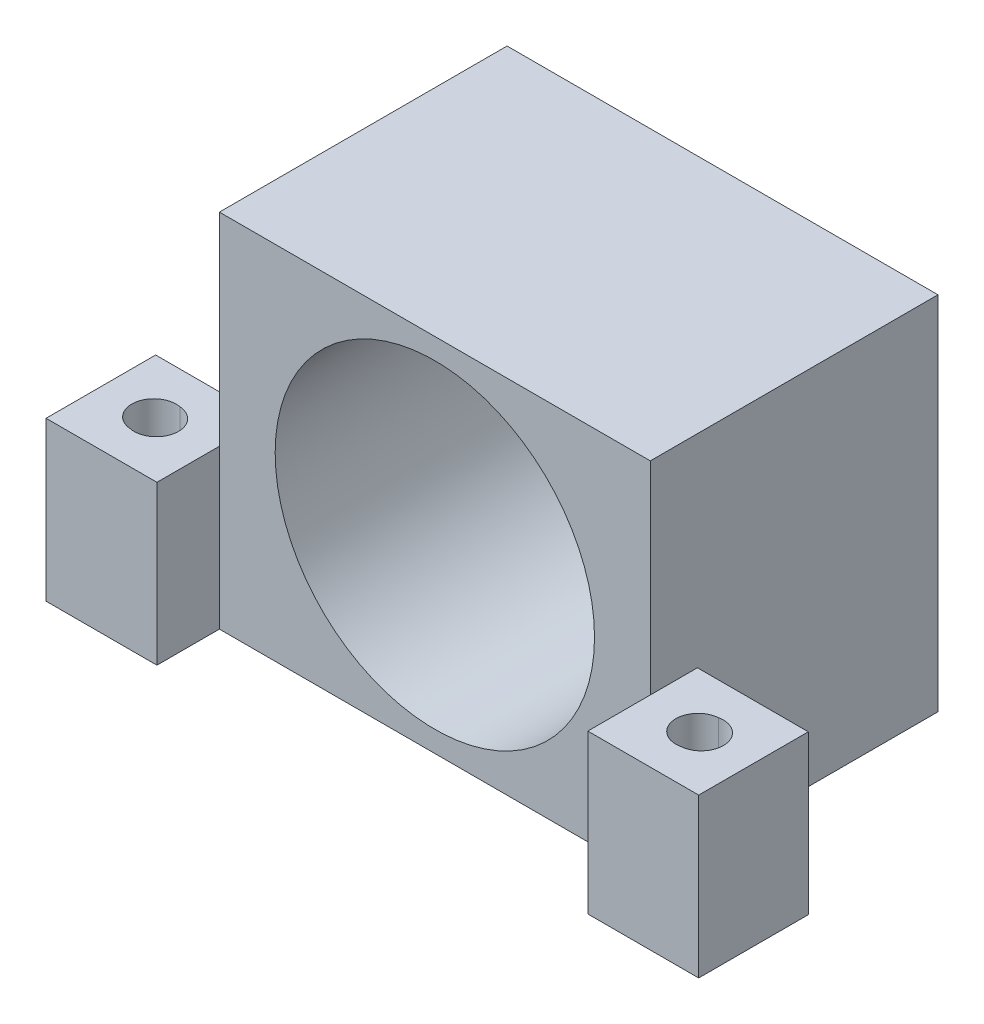
ISO-10303-21;
HEADER;
FILE_DESCRIPTION(('STEP AP214'),'2;1');
FILE_NAME('part.step','',(''),(''),'','','');
FILE_SCHEMA(('AUTOMOTIVE_DESIGN { 1 0 10303 214 1 1 1 1 }'));
ENDSEC;
DATA;
#1=APPLICATION_CONTEXT('core data for automotive mechanical design processes');
#2=APPLICATION_PROTOCOL_DEFINITION('international standard','automotive_design',2000,#1);
#3=PRODUCT_CONTEXT('',#1,'mechanical');
#4=PRODUCT('Part','Part','',(#3));
#5=PRODUCT_RELATED_PRODUCT_CATEGORY('part','',(#4));
#6=PRODUCT_DEFINITION_FORMATION('','',#4);
#7=PRODUCT_DEFINITION_CONTEXT('part definition',#1,'design');
#8=PRODUCT_DEFINITION('design','',#6,#7);
#9=PRODUCT_DEFINITION_SHAPE('','',#8);
#10=(LENGTH_UNIT() NAMED_UNIT(*) SI_UNIT(.MILLI.,.METRE.));
#11=(NAMED_UNIT(*) PLANE_ANGLE_UNIT() SI_UNIT($,.RADIAN.));
#12=(NAMED_UNIT(*) SI_UNIT($,.STERADIAN.) SOLID_ANGLE_UNIT());
#13=UNCERTAINTY_MEASURE_WITH_UNIT(LENGTH_MEASURE(1.E-05),#10,'distance_accuracy_value','');
#14=(GEOMETRIC_REPRESENTATION_CONTEXT(3) GLOBAL_UNCERTAINTY_ASSIGNED_CONTEXT((#13)) GLOBAL_UNIT_ASSIGNED_CONTEXT((#10,
#11,#12)) REPRESENTATION_CONTEXT('',''));
#15=CARTESIAN_POINT('',(0.,0.,0.));
#16=DIRECTION('',(0.,0.,1.));
#17=DIRECTION('',(1.,0.,0.));
#18=AXIS2_PLACEMENT_3D('',#15,#16,#17);
#19=CARTESIAN_POINT('',(21.375,-14.25,23.305));
#20=DIRECTION('',(0.,1.,0.));
#21=DIRECTION('',(-1.,0.,0.));
#22=AXIS2_PLACEMENT_3D('',#19,#20,#21);
#23=CYLINDRICAL_SURFACE('',#22,1.75);
#24=CARTESIAN_POINT('',(21.375,-11.075,23.305));
#25=DIRECTION('',(0.,-1.,0.));
#26=DIRECTION('',(1.,0.,0.));
#27=AXIS2_PLACEMENT_3D('',#24,#25,#26);
#28=CIRCLE('',#27,1.75);
#29=CARTESIAN_POINT('',(21.2411225701097,-11.075,21.5601284191191));
#30=VERTEX_POINT('',#29);
#31=CARTESIAN_POINT('',(21.7238774298904,-11.075,25.0198715808809));
#32=VERTEX_POINT('',#31);
#33=EDGE_CURVE('E175',#30,#32,#28,.F.);
#34=ORIENTED_EDGE('',*,*,#33,.F.);
#35=DIRECTION('',(0.,1.,0.));
#36=VECTOR('',#35,1.);
#37=CARTESIAN_POINT('',(21.2411225701097,-23.75,21.5601284191191));
#38=LINE('',#37,#36);
#39=CARTESIAN_POINT('',(21.2411225701097,-1.75,21.5601284191191));
#40=VERTEX_POINT('',#39);
#41=EDGE_CURVE('E55',#30,#40,#38,.T.);
#42=ORIENTED_EDGE('',*,*,#41,.T.);
#43=CARTESIAN_POINT('',(21.375,-1.75,23.305));
#44=DIRECTION('',(0.,1.,0.));
#45=DIRECTION('',(-1.,0.,0.));
#46=AXIS2_PLACEMENT_3D('',#43,#44,#45);
#47=CIRCLE('',#46,1.75);
#48=CARTESIAN_POINT('',(21.7238774298904,-1.75,25.0198715808809));
#49=VERTEX_POINT('',#48);
#50=EDGE_CURVE('E166',#40,#49,#47,.T.);
#51=ORIENTED_EDGE('',*,*,#50,.T.);
#52=DIRECTION('',(0.,1.,0.));
#53=VECTOR('',#52,1.);
#54=CARTESIAN_POINT('',(21.7238774298904,-23.75,25.0198715808809));
#55=LINE('',#54,#53);
#56=EDGE_CURVE('E343',#49,#32,#55,.F.);
#57=ORIENTED_EDGE('',*,*,#56,.T.);
#58=EDGE_LOOP('',(#34,#42,#51,#57));
#59=FACE_BOUND('',#58,.T.);
#60=ADVANCED_FACE('F33',(#59),#23,.F.);
#61=CARTESIAN_POINT('',(-21.375,-14.25,23.305));
#62=DIRECTION('',(0.,1.,0.));
#63=DIRECTION('',(-1.,0.,0.));
#64=AXIS2_PLACEMENT_3D('',#61,#62,#63);
#65=CYLINDRICAL_SURFACE('',#64,1.75);
#66=CARTESIAN_POINT('',(-21.375,-11.075,23.305));
#67=DIRECTION('',(0.,-1.,0.));
#68=DIRECTION('',(1.,0.,0.));
#69=AXIS2_PLACEMENT_3D('',#66,#67,#68);
#70=CIRCLE('',#69,1.75);
#71=CARTESIAN_POINT('',(-21.7238774298903,-11.075,25.019871580881));
#72=VERTEX_POINT('',#71);
#73=CARTESIAN_POINT('',(-21.2411225701095,-11.075,21.5601284191191));
#74=VERTEX_POINT('',#73);
#75=EDGE_CURVE('E158',#72,#74,#70,.F.);
#76=ORIENTED_EDGE('',*,*,#75,.F.);
#77=DIRECTION('',(0.,1.,0.));
#78=VECTOR('',#77,1.);
#79=CARTESIAN_POINT('',(-21.7238774298903,-23.75,25.019871580881));
#80=LINE('',#79,#78);
#81=CARTESIAN_POINT('',(-21.7238774298903,-1.75,25.019871580881));
#82=VERTEX_POINT('',#81);
#83=EDGE_CURVE('E47',#72,#82,#80,.T.);
#84=ORIENTED_EDGE('',*,*,#83,.T.);
#85=CARTESIAN_POINT('',(-21.375,-1.75,23.305));
#86=DIRECTION('',(0.,1.,0.));
#87=DIRECTION('',(-1.,0.,0.));
#88=AXIS2_PLACEMENT_3D('',#85,#86,#87);
#89=CIRCLE('',#88,1.75);
#90=CARTESIAN_POINT('',(-21.2411225701095,-1.75,21.5601284191191));
#91=VERTEX_POINT('',#90);
#92=EDGE_CURVE('E160',#82,#91,#89,.T.);
#93=ORIENTED_EDGE('',*,*,#92,.T.);
#94=DIRECTION('',(0.,1.,0.));
#95=VECTOR('',#94,1.);
#96=CARTESIAN_POINT('',(-21.2411225701095,-23.75,21.5601284191191));
#97=LINE('',#96,#95);
#98=EDGE_CURVE('E150',#91,#74,#97,.F.);
#99=ORIENTED_EDGE('',*,*,#98,.T.);
#100=EDGE_LOOP('',(#76,#84,#93,#99));
#101=FACE_BOUND('',#100,.T.);
#102=ADVANCED_FACE('F157',(#101),#65,.F.);
#103=CARTESIAN_POINT('',(17.,14.25,22.7));
#104=DIRECTION('',(-1.,0.,0.));
#105=DIRECTION('',(0.,0.,1.));
#106=AXIS2_PLACEMENT_3D('',#103,#104,#105);
#107=PLANE('',#106);
#108=DIRECTION('',(0.,0.,1.));
#109=VECTOR('',#108,1.);
#110=CARTESIAN_POINT('',(17.,-1.75,18.98));
#111=LINE('',#110,#109);
#112=CARTESIAN_POINT('',(17.,-1.75,18.98));
#113=VERTEX_POINT('',#112);
#114=CARTESIAN_POINT('',(17.,-1.75,22.7));
#115=VERTEX_POINT('',#114);
#116=EDGE_CURVE('E289',#113,#115,#111,.T.);
#117=ORIENTED_EDGE('',*,*,#116,.F.);
#118=DIRECTION('',(0.,-1.,0.));
#119=VECTOR('',#118,1.);
#120=CARTESIAN_POINT('',(17.,-1.75,18.98));
#121=LINE('',#120,#119);
#122=CARTESIAN_POINT('',(17.,-14.25,18.98));
#123=VERTEX_POINT('',#122);
#124=EDGE_CURVE('E308',#113,#123,#121,.T.);
#125=ORIENTED_EDGE('',*,*,#124,.T.);
#126=DIRECTION('',(0.,0.,-1.));
#127=VECTOR('',#126,1.);
#128=CARTESIAN_POINT('',(17.,-14.25,22.7));
#129=LINE('',#128,#127);
#130=CARTESIAN_POINT('',(17.,-14.25,0.));
#131=VERTEX_POINT('',#130);
#132=EDGE_CURVE('E194',#123,#131,#129,.T.);
#133=ORIENTED_EDGE('',*,*,#132,.T.);
#134=DIRECTION('',(0.,1.,0.));
#135=VECTOR('',#134,1.);
#136=CARTESIAN_POINT('',(17.,14.25,0.));
#137=LINE('',#136,#135);
#138=CARTESIAN_POINT('',(17.,14.25,0.));
#139=VERTEX_POINT('',#138);
#140=EDGE_CURVE('E214',#131,#139,#137,.T.);
#141=ORIENTED_EDGE('',*,*,#140,.T.);
#142=DIRECTION('',(0.,0.,-1.));
#143=VECTOR('',#142,1.);
#144=CARTESIAN_POINT('',(17.,14.25,22.7));
#145=LINE('',#144,#143);
#146=CARTESIAN_POINT('',(17.,14.25,22.7));
#147=VERTEX_POINT('',#146);
#148=EDGE_CURVE('E200',#147,#139,#145,.T.);
#149=ORIENTED_EDGE('',*,*,#148,.F.);
#150=DIRECTION('',(0.,1.,0.));
#151=VECTOR('',#150,1.);
#152=CARTESIAN_POINT('',(17.,14.25,22.7));
#153=LINE('',#152,#151);
#154=EDGE_CURVE('E226',#115,#147,#153,.T.);
#155=ORIENTED_EDGE('',*,*,#154,.F.);
#156=EDGE_LOOP('',(#117,#125,#133,#141,#149,#155));
#157=FACE_BOUND('',#156,.T.);
#158=ADVANCED_FACE('F391',(#157),#107,.F.);
#159=CARTESIAN_POINT('',(-17.,14.25,22.7));
#160=DIRECTION('',(1.,0.,0.));
#161=DIRECTION('',(0.,0.,-1.));
#162=AXIS2_PLACEMENT_3D('',#159,#160,#161);
#163=PLANE('',#162);
#164=DIRECTION('',(0.,1.,0.));
#165=VECTOR('',#164,1.);
#166=CARTESIAN_POINT('',(-17.,-1.75,18.98));
#167=LINE('',#166,#165);
#168=CARTESIAN_POINT('',(-17.,-14.25,18.98));
#169=VERTEX_POINT('',#168);
#170=CARTESIAN_POINT('',(-17.,-1.75,18.98));
#171=VERTEX_POINT('',#170);
#172=EDGE_CURVE('E274',#169,#171,#167,.T.);
#173=ORIENTED_EDGE('',*,*,#172,.T.);
#174=DIRECTION('',(0.,0.,1.));
#175=VECTOR('',#174,1.);
#176=CARTESIAN_POINT('',(-17.,-1.75,18.98));
#177=LINE('',#176,#175);
#178=CARTESIAN_POINT('',(-17.,-1.75,22.7));
#179=VERTEX_POINT('',#178);
#180=EDGE_CURVE('E257',#171,#179,#177,.T.);
#181=ORIENTED_EDGE('',*,*,#180,.T.);
#182=DIRECTION('',(0.,-1.,0.));
#183=VECTOR('',#182,1.);
#184=CARTESIAN_POINT('',(-17.,14.25,22.7));
#185=LINE('',#184,#183);
#186=CARTESIAN_POINT('',(-17.,14.25,22.7));
#187=VERTEX_POINT('',#186);
#188=EDGE_CURVE('E230',#187,#179,#185,.T.);
#189=ORIENTED_EDGE('',*,*,#188,.F.);
#190=DIRECTION('',(0.,0.,-1.));
#191=VECTOR('',#190,1.);
#192=CARTESIAN_POINT('',(-17.,14.25,22.7));
#193=LINE('',#192,#191);
#194=CARTESIAN_POINT('',(-17.,14.25,0.));
#195=VERTEX_POINT('',#194);
#196=EDGE_CURVE('E205',#187,#195,#193,.T.);
#197=ORIENTED_EDGE('',*,*,#196,.T.);
#198=DIRECTION('',(0.,-1.,0.));
#199=VECTOR('',#198,1.);
#200=CARTESIAN_POINT('',(-17.,14.25,0.));
#201=LINE('',#200,#199);
#202=CARTESIAN_POINT('',(-17.,-14.25,0.));
#203=VERTEX_POINT('',#202);
#204=EDGE_CURVE('E218',#195,#203,#201,.T.);
#205=ORIENTED_EDGE('',*,*,#204,.T.);
#206=DIRECTION('',(0.,0.,-1.));
#207=VECTOR('',#206,1.);
#208=CARTESIAN_POINT('',(-17.,-14.25,22.7));
#209=LINE('',#208,#207);
#210=EDGE_CURVE('E173',#169,#203,#209,.T.);
#211=ORIENTED_EDGE('',*,*,#210,.F.);
#212=EDGE_LOOP('',(#173,#181,#189,#197,#205,#211));
#213=FACE_BOUND('',#212,.T.);
#214=ADVANCED_FACE('F35',(#213),#163,.F.);
#215=CARTESIAN_POINT('',(17.,-14.25,22.7));
#216=DIRECTION('',(0.,1.,0.));
#217=DIRECTION('',(0.,0.,1.));
#218=AXIS2_PLACEMENT_3D('',#215,#216,#217);
#219=PLANE('',#218);
#220=CARTESIAN_POINT('',(21.375,-14.25,23.305));
#221=DIRECTION('',(0.,-1.,0.));
#222=DIRECTION('',(1.,0.,0.));
#223=AXIS2_PLACEMENT_3D('',#220,#221,#222);
#224=CIRCLE('',#223,3.25);
#225=CARTESIAN_POINT('',(24.625,-14.25,23.305));
#226=VERTEX_POINT('',#225);
#227=EDGE_CURVE('E182',#226,#226,#224,.T.);
#228=ORIENTED_EDGE('',*,*,#227,.F.);
#229=EDGE_LOOP('',(#228));
#230=FACE_BOUND('',#229,.T.);
#231=CARTESIAN_POINT('',(-21.375,-14.25,23.305));
#232=DIRECTION('',(0.,-1.,0.));
#233=DIRECTION('',(1.,0.,0.));
#234=AXIS2_PLACEMENT_3D('',#231,#232,#233);
#235=CIRCLE('',#234,3.25);
#236=CARTESIAN_POINT('',(-18.125,-14.25,23.305));
#237=VERTEX_POINT('',#236);
#238=EDGE_CURVE('E169',#237,#237,#235,.T.);
#239=ORIENTED_EDGE('',*,*,#238,.F.);
#240=EDGE_LOOP('',(#239));
#241=FACE_BOUND('',#240,.T.);
#242=DIRECTION('',(1.,0.,0.));
#243=VECTOR('',#242,1.);
#244=CARTESIAN_POINT('',(17.,-14.25,0.));
#245=LINE('',#244,#243);
#246=EDGE_CURVE('E216',#203,#131,#245,.T.);
#247=ORIENTED_EDGE('',*,*,#246,.T.);
#248=ORIENTED_EDGE('',*,*,#132,.F.);
#249=DIRECTION('',(1.,0.,0.));
#250=VECTOR('',#249,1.);
#251=CARTESIAN_POINT('',(17.,-14.25,18.98));
#252=LINE('',#251,#250);
#253=CARTESIAN_POINT('',(25.75,-14.25,18.98));
#254=VERTEX_POINT('',#253);
#255=EDGE_CURVE('E305',#123,#254,#252,.T.);
#256=ORIENTED_EDGE('',*,*,#255,.T.);
#257=DIRECTION('',(0.,0.,1.));
#258=VECTOR('',#257,1.);
#259=CARTESIAN_POINT('',(25.75,-14.25,18.98));
#260=LINE('',#259,#258);
#261=CARTESIAN_POINT('',(25.75,-14.25,27.63));
#262=VERTEX_POINT('',#261);
#263=EDGE_CURVE('E292',#254,#262,#260,.T.);
#264=ORIENTED_EDGE('',*,*,#263,.T.);
#265=DIRECTION('',(1.,0.,0.));
#266=VECTOR('',#265,1.);
#267=CARTESIAN_POINT('',(17.,-14.25,27.63));
#268=LINE('',#267,#266);
#269=CARTESIAN_POINT('',(17.,-14.25,27.63));
#270=VERTEX_POINT('',#269);
#271=EDGE_CURVE('E316',#270,#262,#268,.T.);
#272=ORIENTED_EDGE('',*,*,#271,.F.);
#273=DIRECTION('',(0.,0.,1.));
#274=VECTOR('',#273,1.);
#275=CARTESIAN_POINT('',(17.,-14.25,18.98));
#276=LINE('',#275,#274);
#277=CARTESIAN_POINT('',(17.,-14.25,22.7));
#278=VERTEX_POINT('',#277);
#279=EDGE_CURVE('E290',#278,#270,#276,.T.);
#280=ORIENTED_EDGE('',*,*,#279,.F.);
#281=DIRECTION('',(1.,0.,0.));
#282=VECTOR('',#281,1.);
#283=CARTESIAN_POINT('',(17.,-14.25,22.7));
#284=LINE('',#283,#282);
#285=CARTESIAN_POINT('',(-17.,-14.25,22.7));
#286=VERTEX_POINT('',#285);
#287=EDGE_CURVE('E227',#286,#278,#284,.T.);
#288=ORIENTED_EDGE('',*,*,#287,.F.);
#289=DIRECTION('',(0.,0.,1.));
#290=VECTOR('',#289,1.);
#291=CARTESIAN_POINT('',(-17.,-14.25,18.98));
#292=LINE('',#291,#290);
#293=CARTESIAN_POINT('',(-17.,-14.25,27.63));
#294=VERTEX_POINT('',#293);
#295=EDGE_CURVE('E252',#286,#294,#292,.T.);
#296=ORIENTED_EDGE('',*,*,#295,.T.);
#297=DIRECTION('',(1.,0.,0.));
#298=VECTOR('',#297,1.);
#299=CARTESIAN_POINT('',(-17.,-14.25,27.63));
#300=LINE('',#299,#298);
#301=CARTESIAN_POINT('',(-25.75,-14.25,27.63));
#302=VERTEX_POINT('',#301);
#303=EDGE_CURVE('E277',#302,#294,#300,.T.);
#304=ORIENTED_EDGE('',*,*,#303,.F.);
#305=DIRECTION('',(0.,0.,1.));
#306=VECTOR('',#305,1.);
#307=CARTESIAN_POINT('',(-25.75,-14.25,18.98));
#308=LINE('',#307,#306);
#309=CARTESIAN_POINT('',(-25.75,-14.25,18.98));
#310=VERTEX_POINT('',#309);
#311=EDGE_CURVE('E263',#310,#302,#308,.T.);
#312=ORIENTED_EDGE('',*,*,#311,.F.);
#313=DIRECTION('',(1.,0.,0.));
#314=VECTOR('',#313,1.);
#315=CARTESIAN_POINT('',(-17.,-14.25,18.98));
#316=LINE('',#315,#314);
#317=EDGE_CURVE('E266',#310,#169,#316,.T.);
#318=ORIENTED_EDGE('',*,*,#317,.T.);
#319=ORIENTED_EDGE('',*,*,#210,.T.);
#320=EDGE_LOOP('',(#247,#248,#256,#264,#272,#280,#288,#296,#304,#312,#318,#319));
#321=FACE_BOUND('',#320,.T.);
#322=ADVANCED_FACE('F365',(#230,#241,#321),#219,.F.);
#323=CARTESIAN_POINT('',(-17.,14.25,22.7));
#324=DIRECTION('',(0.,-1.,0.));
#325=DIRECTION('',(0.,0.,-1.));
#326=AXIS2_PLACEMENT_3D('',#323,#324,#325);
#327=PLANE('',#326);
#328=DIRECTION('',(-1.,0.,0.));
#329=VECTOR('',#328,1.);
#330=CARTESIAN_POINT('',(-17.,14.25,0.));
#331=LINE('',#330,#329);
#332=EDGE_CURVE('E211',#139,#195,#331,.T.);
#333=ORIENTED_EDGE('',*,*,#332,.T.);
#334=ORIENTED_EDGE('',*,*,#196,.F.);
#335=DIRECTION('',(-1.,0.,0.));
#336=VECTOR('',#335,1.);
#337=CARTESIAN_POINT('',(-17.,14.25,22.7));
#338=LINE('',#337,#336);
#339=EDGE_CURVE('E210',#147,#187,#338,.T.);
#340=ORIENTED_EDGE('',*,*,#339,.F.);
#341=ORIENTED_EDGE('',*,*,#148,.T.);
#342=EDGE_LOOP('',(#333,#334,#340,#341));
#343=FACE_BOUND('',#342,.T.);
#344=ADVANCED_FACE('F379',(#343),#327,.F.);
#345=CARTESIAN_POINT('',(0.,0.,22.7));
#346=DIRECTION('',(0.,0.,-1.));
#347=DIRECTION('',(-1.,0.,0.));
#348=AXIS2_PLACEMENT_3D('',#345,#346,#347);
#349=PLANE('',#348);
#350=CARTESIAN_POINT('',(0.,0.,22.7));
#351=DIRECTION('',(0.,0.,1.));
#352=DIRECTION('',(1.,0.,0.));
#353=AXIS2_PLACEMENT_3D('',#350,#351,#352);
#354=CIRCLE('',#353,12.6);
#355=CARTESIAN_POINT('',(12.6,0.,22.7));
#356=VERTEX_POINT('',#355);
#357=EDGE_CURVE('E233',#356,#356,#354,.T.);
#358=ORIENTED_EDGE('',*,*,#357,.F.);
#359=EDGE_LOOP('',(#358));
#360=FACE_BOUND('',#359,.T.);
#361=ORIENTED_EDGE('',*,*,#188,.T.);
#362=EDGE_CURVE('E213',#179,#286,#185,.T.);
#363=ORIENTED_EDGE('',*,*,#362,.T.);
#364=ORIENTED_EDGE('',*,*,#287,.T.);
#365=EDGE_CURVE('E223',#278,#115,#153,.T.);
#366=ORIENTED_EDGE('',*,*,#365,.T.);
#367=ORIENTED_EDGE('',*,*,#154,.T.);
#368=ORIENTED_EDGE('',*,*,#339,.T.);
#369=EDGE_LOOP('',(#361,#363,#364,#366,#367,#368));
#370=FACE_BOUND('',#369,.T.);
#371=ADVANCED_FACE('F373',(#360,#370),#349,.F.);
#372=CARTESIAN_POINT('',(0.,0.,0.));
#373=DIRECTION('',(0.,0.,-1.));
#374=DIRECTION('',(-1.,0.,0.));
#375=AXIS2_PLACEMENT_3D('',#372,#373,#374);
#376=PLANE('',#375);
#377=CARTESIAN_POINT('',(-6.01040764008568,6.01040764008562,0.));
#378=DIRECTION('',(0.,0.,-1.));
#379=DIRECTION('',(-1.,0.,0.));
#380=AXIS2_PLACEMENT_3D('',#377,#378,#379);
#381=CIRCLE('',#380,2.8);
#382=CARTESIAN_POINT('',(-8.81040764008569,6.01040764008562,0.));
#383=VERTEX_POINT('',#382);
#384=EDGE_CURVE('E188',#383,#383,#381,.T.);
#385=ORIENTED_EDGE('',*,*,#384,.F.);
#386=EDGE_LOOP('',(#385));
#387=FACE_BOUND('',#386,.T.);
#388=CARTESIAN_POINT('',(6.01040764008569,-6.01040764008562,0.));
#389=DIRECTION('',(0.,0.,-1.));
#390=DIRECTION('',(-1.,0.,0.));
#391=AXIS2_PLACEMENT_3D('',#388,#389,#390);
#392=CIRCLE('',#391,2.8);
#393=CARTESIAN_POINT('',(3.21040764008569,-6.01040764008562,0.));
#394=VERTEX_POINT('',#393);
#395=EDGE_CURVE('E335',#394,#394,#392,.T.);
#396=ORIENTED_EDGE('',*,*,#395,.F.);
#397=EDGE_LOOP('',(#396));
#398=FACE_BOUND('',#397,.T.);
#399=CARTESIAN_POINT('',(6.01040764008564,6.01040764008567,0.));
#400=DIRECTION('',(0.,0.,-1.));
#401=DIRECTION('',(-1.,0.,0.));
#402=AXIS2_PLACEMENT_3D('',#399,#400,#401);
#403=CIRCLE('',#402,2.8);
#404=CARTESIAN_POINT('',(3.21040764008564,6.01040764008567,0.));
#405=VERTEX_POINT('',#404);
#406=EDGE_CURVE('E332',#405,#405,#403,.T.);
#407=ORIENTED_EDGE('',*,*,#406,.F.);
#408=EDGE_LOOP('',(#407));
#409=FACE_BOUND('',#408,.T.);
#410=CARTESIAN_POINT('',(-6.01040764008564,-6.01040764008566,0.));
#411=DIRECTION('',(0.,0.,-1.));
#412=DIRECTION('',(-1.,0.,0.));
#413=AXIS2_PLACEMENT_3D('',#410,#411,#412);
#414=CIRCLE('',#413,2.8);
#415=CARTESIAN_POINT('',(-8.81040764008564,-6.01040764008566,0.));
#416=VERTEX_POINT('',#415);
#417=EDGE_CURVE('E183',#416,#416,#414,.T.);
#418=ORIENTED_EDGE('',*,*,#417,.F.);
#419=EDGE_LOOP('',(#418));
#420=FACE_BOUND('',#419,.T.);
#421=CARTESIAN_POINT('',(0.,0.,0.));
#422=DIRECTION('',(0.,0.,1.));
#423=DIRECTION('',(1.,0.,0.));
#424=AXIS2_PLACEMENT_3D('',#421,#422,#423);
#425=CIRCLE('',#424,3.75);
#426=CARTESIAN_POINT('',(3.75,0.,0.));
#427=VERTEX_POINT('',#426);
#428=EDGE_CURVE('E251',#427,#427,#425,.T.);
#429=ORIENTED_EDGE('',*,*,#428,.T.);
#430=EDGE_LOOP('',(#429));
#431=FACE_BOUND('',#430,.T.);
#432=ORIENTED_EDGE('',*,*,#204,.F.);
#433=ORIENTED_EDGE('',*,*,#332,.F.);
#434=ORIENTED_EDGE('',*,*,#140,.F.);
#435=ORIENTED_EDGE('',*,*,#246,.F.);
#436=EDGE_LOOP('',(#432,#433,#434,#435));
#437=FACE_BOUND('',#436,.T.);
#438=ADVANCED_FACE('F383',(#387,#398,#409,#420,#431,#437),#376,.T.);
#439=CARTESIAN_POINT('',(0.,0.,3.7));
#440=DIRECTION('',(0.,0.,1.));
#441=DIRECTION('',(1.,0.,0.));
#442=AXIS2_PLACEMENT_3D('',#439,#440,#441);
#443=CYLINDRICAL_SURFACE('',#442,12.6);
#444=CARTESIAN_POINT('',(0.,0.,3.7));
#445=DIRECTION('',(0.,0.,1.));
#446=DIRECTION('',(1.,0.,0.));
#447=AXIS2_PLACEMENT_3D('',#444,#445,#446);
#448=CIRCLE('',#447,12.6);
#449=CARTESIAN_POINT('',(12.6,0.,3.7));
#450=VERTEX_POINT('',#449);
#451=EDGE_CURVE('E221',#450,#450,#448,.T.);
#452=ORIENTED_EDGE('',*,*,#451,.F.);
#453=EDGE_LOOP('',(#452));
#454=FACE_BOUND('',#453,.T.);
#455=ORIENTED_EDGE('',*,*,#357,.T.);
#456=EDGE_LOOP('',(#455));
#457=FACE_BOUND('',#456,.T.);
#458=ADVANCED_FACE('F628',(#454,#457),#443,.F.);
#459=CARTESIAN_POINT('',(0.,0.,3.7));
#460=DIRECTION('',(0.,0.,1.));
#461=DIRECTION('',(1.,0.,0.));
#462=AXIS2_PLACEMENT_3D('',#459,#460,#461);
#463=PLANE('',#462);
#464=CARTESIAN_POINT('',(0.,0.,3.7));
#465=DIRECTION('',(0.,0.,1.));
#466=DIRECTION('',(1.,0.,0.));
#467=AXIS2_PLACEMENT_3D('',#464,#465,#466);
#468=CIRCLE('',#467,3.75);
#469=CARTESIAN_POINT('',(3.75,0.,3.7));
#470=VERTEX_POINT('',#469);
#471=EDGE_CURVE('E248',#470,#470,#468,.T.);
#472=ORIENTED_EDGE('',*,*,#471,.F.);
#473=EDGE_LOOP('',(#472));
#474=FACE_BOUND('',#473,.T.);
#475=CARTESIAN_POINT('',(-6.01040764008565,-6.01040764008566,3.7));
#476=DIRECTION('',(0.,0.,1.));
#477=DIRECTION('',(1.,0.,0.));
#478=AXIS2_PLACEMENT_3D('',#475,#476,#477);
#479=CIRCLE('',#478,1.625);
#480=CARTESIAN_POINT('',(-4.38540764008565,-6.01040764008566,3.7));
#481=VERTEX_POINT('',#480);
#482=EDGE_CURVE('E245',#481,#481,#479,.T.);
#483=ORIENTED_EDGE('',*,*,#482,.F.);
#484=EDGE_LOOP('',(#483));
#485=FACE_BOUND('',#484,.T.);
#486=CARTESIAN_POINT('',(6.01040764008566,-6.01040764008565,3.7));
#487=DIRECTION('',(0.,0.,1.));
#488=DIRECTION('',(1.,0.,0.));
#489=AXIS2_PLACEMENT_3D('',#486,#487,#488);
#490=CIRCLE('',#489,1.625);
#491=CARTESIAN_POINT('',(7.63540764008566,-6.01040764008565,3.7));
#492=VERTEX_POINT('',#491);
#493=EDGE_CURVE('E242',#492,#492,#490,.T.);
#494=ORIENTED_EDGE('',*,*,#493,.F.);
#495=EDGE_LOOP('',(#494));
#496=FACE_BOUND('',#495,.T.);
#497=CARTESIAN_POINT('',(-6.01040764008566,6.01040764008565,3.7));
#498=DIRECTION('',(0.,0.,1.));
#499=DIRECTION('',(1.,0.,0.));
#500=AXIS2_PLACEMENT_3D('',#497,#498,#499);
#501=CIRCLE('',#500,1.625);
#502=CARTESIAN_POINT('',(-4.38540764008566,6.01040764008565,3.7));
#503=VERTEX_POINT('',#502);
#504=EDGE_CURVE('E241',#503,#503,#501,.T.);
#505=ORIENTED_EDGE('',*,*,#504,.F.);
#506=EDGE_LOOP('',(#505));
#507=FACE_BOUND('',#506,.T.);
#508=CARTESIAN_POINT('',(6.01040764008565,6.01040764008566,3.7));
#509=DIRECTION('',(0.,0.,1.));
#510=DIRECTION('',(1.,0.,0.));
#511=AXIS2_PLACEMENT_3D('',#508,#509,#510);
#512=CIRCLE('',#511,1.625);
#513=CARTESIAN_POINT('',(7.63540764008565,6.01040764008566,3.7));
#514=VERTEX_POINT('',#513);
#515=EDGE_CURVE('E236',#514,#514,#512,.T.);
#516=ORIENTED_EDGE('',*,*,#515,.F.);
#517=EDGE_LOOP('',(#516));
#518=FACE_BOUND('',#517,.T.);
#519=ORIENTED_EDGE('',*,*,#451,.T.);
#520=EDGE_LOOP('',(#519));
#521=FACE_BOUND('',#520,.T.);
#522=ADVANCED_FACE('F636',(#474,#485,#496,#507,#518,#521),#463,.T.);
#523=CARTESIAN_POINT('',(6.01040764008565,6.01040764008566,0.));
#524=DIRECTION('',(0.,0.,1.));
#525=DIRECTION('',(1.,0.,0.));
#526=AXIS2_PLACEMENT_3D('',#523,#524,#525);
#527=CYLINDRICAL_SURFACE('',#526,1.625);
#528=CARTESIAN_POINT('',(6.01040764008564,6.01040764008567,1.175));
#529=DIRECTION('',(0.,0.,-1.));
#530=DIRECTION('',(-1.,0.,0.));
#531=AXIS2_PLACEMENT_3D('',#528,#529,#530);
#532=CIRCLE('',#531,1.625);
#533=CARTESIAN_POINT('',(4.38540764008564,6.01040764008567,1.175));
#534=VERTEX_POINT('',#533);
#535=EDGE_CURVE('E191',#534,#534,#532,.T.);
#536=ORIENTED_EDGE('',*,*,#535,.T.);
#537=EDGE_LOOP('',(#536));
#538=FACE_BOUND('',#537,.T.);
#539=ORIENTED_EDGE('',*,*,#515,.T.);
#540=EDGE_LOOP('',(#539));
#541=FACE_BOUND('',#540,.T.);
#542=ADVANCED_FACE('F644',(#538,#541),#527,.F.);
#543=CARTESIAN_POINT('',(-6.01040764008566,6.01040764008565,0.));
#544=DIRECTION('',(0.,0.,1.));
#545=DIRECTION('',(1.,0.,0.));
#546=AXIS2_PLACEMENT_3D('',#543,#544,#545);
#547=CYLINDRICAL_SURFACE('',#546,1.625);
#548=CARTESIAN_POINT('',(-6.01040764008568,6.01040764008562,1.175));
#549=DIRECTION('',(0.,0.,-1.));
#550=DIRECTION('',(-1.,0.,0.));
#551=AXIS2_PLACEMENT_3D('',#548,#549,#550);
#552=CIRCLE('',#551,1.625);
#553=CARTESIAN_POINT('',(-7.63540764008568,6.01040764008562,1.175));
#554=VERTEX_POINT('',#553);
#555=EDGE_CURVE('E187',#554,#554,#552,.T.);
#556=ORIENTED_EDGE('',*,*,#555,.T.);
#557=EDGE_LOOP('',(#556));
#558=FACE_BOUND('',#557,.T.);
#559=ORIENTED_EDGE('',*,*,#504,.T.);
#560=EDGE_LOOP('',(#559));
#561=FACE_BOUND('',#560,.T.);
#562=ADVANCED_FACE('F652',(#558,#561),#547,.F.);
#563=CARTESIAN_POINT('',(6.01040764008566,-6.01040764008565,0.));
#564=DIRECTION('',(0.,0.,1.));
#565=DIRECTION('',(1.,0.,0.));
#566=AXIS2_PLACEMENT_3D('',#563,#564,#565);
#567=CYLINDRICAL_SURFACE('',#566,1.625);
#568=CARTESIAN_POINT('',(6.01040764008569,-6.01040764008562,1.175));
#569=DIRECTION('',(0.,0.,-1.));
#570=DIRECTION('',(-1.,0.,0.));
#571=AXIS2_PLACEMENT_3D('',#568,#569,#570);
#572=CIRCLE('',#571,1.625);
#573=CARTESIAN_POINT('',(4.38540764008569,-6.01040764008562,1.175));
#574=VERTEX_POINT('',#573);
#575=EDGE_CURVE('E184',#574,#574,#572,.T.);
#576=ORIENTED_EDGE('',*,*,#575,.T.);
#577=EDGE_LOOP('',(#576));
#578=FACE_BOUND('',#577,.T.);
#579=ORIENTED_EDGE('',*,*,#493,.T.);
#580=EDGE_LOOP('',(#579));
#581=FACE_BOUND('',#580,.T.);
#582=ADVANCED_FACE('F660',(#578,#581),#567,.F.);
#583=CARTESIAN_POINT('',(-6.01040764008565,-6.01040764008566,0.));
#584=DIRECTION('',(0.,0.,1.));
#585=DIRECTION('',(1.,0.,0.));
#586=AXIS2_PLACEMENT_3D('',#583,#584,#585);
#587=CYLINDRICAL_SURFACE('',#586,1.625);
#588=CARTESIAN_POINT('',(-6.01040764008564,-6.01040764008566,1.175));
#589=DIRECTION('',(0.,0.,-1.));
#590=DIRECTION('',(-1.,0.,0.));
#591=AXIS2_PLACEMENT_3D('',#588,#589,#590);
#592=CIRCLE('',#591,1.625);
#593=CARTESIAN_POINT('',(-7.63540764008564,-6.01040764008566,1.175));
#594=VERTEX_POINT('',#593);
#595=EDGE_CURVE('E179',#594,#594,#592,.T.);
#596=ORIENTED_EDGE('',*,*,#595,.T.);
#597=EDGE_LOOP('',(#596));
#598=FACE_BOUND('',#597,.T.);
#599=ORIENTED_EDGE('',*,*,#482,.T.);
#600=EDGE_LOOP('',(#599));
#601=FACE_BOUND('',#600,.T.);
#602=ADVANCED_FACE('F668',(#598,#601),#587,.F.);
#603=CARTESIAN_POINT('',(0.,0.,0.));
#604=DIRECTION('',(0.,0.,1.));
#605=DIRECTION('',(1.,0.,0.));
#606=AXIS2_PLACEMENT_3D('',#603,#604,#605);
#607=CYLINDRICAL_SURFACE('',#606,3.75);
#608=ORIENTED_EDGE('',*,*,#428,.F.);
#609=EDGE_LOOP('',(#608));
#610=FACE_BOUND('',#609,.T.);
#611=ORIENTED_EDGE('',*,*,#471,.T.);
#612=EDGE_LOOP('',(#611));
#613=FACE_BOUND('',#612,.T.);
#614=ADVANCED_FACE('F593',(#610,#613),#607,.F.);
#615=CARTESIAN_POINT('',(-17.,-1.75,18.98));
#616=DIRECTION('',(1.,0.,0.));
#617=DIRECTION('',(0.,0.,-1.));
#618=AXIS2_PLACEMENT_3D('',#615,#616,#617);
#619=PLANE('',#618);
#620=ORIENTED_EDGE('',*,*,#362,.F.);
#621=CARTESIAN_POINT('',(-17.,-1.75,27.63));
#622=VERTEX_POINT('',#621);
#623=EDGE_CURVE('E261',#179,#622,#177,.T.);
#624=ORIENTED_EDGE('',*,*,#623,.T.);
#625=DIRECTION('',(0.,1.,0.));
#626=VECTOR('',#625,1.);
#627=CARTESIAN_POINT('',(-17.,-1.75,27.63));
#628=LINE('',#627,#626);
#629=EDGE_CURVE('E286',#294,#622,#628,.T.);
#630=ORIENTED_EDGE('',*,*,#629,.F.);
#631=ORIENTED_EDGE('',*,*,#295,.F.);
#632=EDGE_LOOP('',(#620,#624,#630,#631));
#633=FACE_BOUND('',#632,.T.);
#634=ADVANCED_FACE('F368',(#633),#619,.T.);
#635=CARTESIAN_POINT('',(-25.75,-1.75,18.98));
#636=DIRECTION('',(-1.,0.,0.));
#637=DIRECTION('',(0.,-1.,0.));
#638=AXIS2_PLACEMENT_3D('',#635,#636,#637);
#639=PLANE('',#638);
#640=ORIENTED_EDGE('',*,*,#311,.T.);
#641=DIRECTION('',(0.,-1.,0.));
#642=VECTOR('',#641,1.);
#643=CARTESIAN_POINT('',(-25.75,-1.75,27.63));
#644=LINE('',#643,#642);
#645=CARTESIAN_POINT('',(-25.75,-1.75,27.63));
#646=VERTEX_POINT('',#645);
#647=EDGE_CURVE('E280',#646,#302,#644,.T.);
#648=ORIENTED_EDGE('',*,*,#647,.F.);
#649=DIRECTION('',(0.,0.,1.));
#650=VECTOR('',#649,1.);
#651=CARTESIAN_POINT('',(-25.75,-1.75,18.98));
#652=LINE('',#651,#650);
#653=CARTESIAN_POINT('',(-25.75,-1.75,18.98));
#654=VERTEX_POINT('',#653);
#655=EDGE_CURVE('E260',#654,#646,#652,.T.);
#656=ORIENTED_EDGE('',*,*,#655,.F.);
#657=DIRECTION('',(0.,-1.,0.));
#658=VECTOR('',#657,1.);
#659=CARTESIAN_POINT('',(-25.75,-1.75,18.98));
#660=LINE('',#659,#658);
#661=EDGE_CURVE('E268',#654,#310,#660,.T.);
#662=ORIENTED_EDGE('',*,*,#661,.T.);
#663=EDGE_LOOP('',(#640,#648,#656,#662));
#664=FACE_BOUND('',#663,.T.);
#665=ADVANCED_FACE('F352',(#664),#639,.T.);
#666=CARTESIAN_POINT('',(-17.,-1.75,18.98));
#667=DIRECTION('',(0.,1.,0.));
#668=DIRECTION('',(-1.,0.,0.));
#669=AXIS2_PLACEMENT_3D('',#666,#667,#668);
#670=PLANE('',#669);
#671=CARTESIAN_POINT('',(-21.59,-1.75,23.275));
#672=DIRECTION('',(0.,1.,0.));
#673=DIRECTION('',(-1.,0.,0.));
#674=AXIS2_PLACEMENT_3D('',#671,#672,#673);
#675=CIRCLE('',#674,1.75000000000001);
#676=EDGE_CURVE('E345',#91,#82,#675,.T.);
#677=ORIENTED_EDGE('',*,*,#676,.F.);
#678=ORIENTED_EDGE('',*,*,#92,.F.);
#679=EDGE_LOOP('',(#677,#678));
#680=FACE_BOUND('',#679,.T.);
#681=ORIENTED_EDGE('',*,*,#655,.T.);
#682=DIRECTION('',(-1.,0.,0.));
#683=VECTOR('',#682,1.);
#684=CARTESIAN_POINT('',(-17.,-1.75,27.63));
#685=LINE('',#684,#683);
#686=EDGE_CURVE('E283',#622,#646,#685,.T.);
#687=ORIENTED_EDGE('',*,*,#686,.F.);
#688=ORIENTED_EDGE('',*,*,#623,.F.);
#689=ORIENTED_EDGE('',*,*,#180,.F.);
#690=DIRECTION('',(-1.,0.,0.));
#691=VECTOR('',#690,1.);
#692=CARTESIAN_POINT('',(-17.,-1.75,18.98));
#693=LINE('',#692,#691);
#694=EDGE_CURVE('E271',#171,#654,#693,.T.);
#695=ORIENTED_EDGE('',*,*,#694,.T.);
#696=EDGE_LOOP('',(#681,#687,#688,#689,#695));
#697=FACE_BOUND('',#696,.T.);
#698=ADVANCED_FACE('F348',(#680,#697),#670,.T.);
#699=CARTESIAN_POINT('',(0.,0.,18.98));
#700=DIRECTION('',(0.,0.,-1.));
#701=DIRECTION('',(-1.,0.,0.));
#702=AXIS2_PLACEMENT_3D('',#699,#700,#701);
#703=PLANE('',#702);
#704=ORIENTED_EDGE('',*,*,#172,.F.);
#705=ORIENTED_EDGE('',*,*,#317,.F.);
#706=ORIENTED_EDGE('',*,*,#661,.F.);
#707=ORIENTED_EDGE('',*,*,#694,.F.);
#708=EDGE_LOOP('',(#704,#705,#706,#707));
#709=FACE_BOUND('',#708,.T.);
#710=ADVANCED_FACE('F351',(#709),#703,.T.);
#711=CARTESIAN_POINT('',(0.,0.,27.63));
#712=DIRECTION('',(0.,0.,-1.));
#713=DIRECTION('',(-1.,0.,0.));
#714=AXIS2_PLACEMENT_3D('',#711,#712,#713);
#715=PLANE('',#714);
#716=ORIENTED_EDGE('',*,*,#629,.T.);
#717=ORIENTED_EDGE('',*,*,#686,.T.);
#718=ORIENTED_EDGE('',*,*,#647,.T.);
#719=ORIENTED_EDGE('',*,*,#303,.T.);
#720=EDGE_LOOP('',(#716,#717,#718,#719));
#721=FACE_BOUND('',#720,.T.);
#722=ADVANCED_FACE('F361',(#721),#715,.F.);
#723=CARTESIAN_POINT('',(17.,-1.75,18.98));
#724=DIRECTION('',(-1.,0.,0.));
#725=DIRECTION('',(0.,0.,1.));
#726=AXIS2_PLACEMENT_3D('',#723,#724,#725);
#727=PLANE('',#726);
#728=ORIENTED_EDGE('',*,*,#365,.F.);
#729=ORIENTED_EDGE('',*,*,#279,.T.);
#730=DIRECTION('',(0.,-1.,0.));
#731=VECTOR('',#730,1.);
#732=CARTESIAN_POINT('',(17.,-1.75,27.63));
#733=LINE('',#732,#731);
#734=CARTESIAN_POINT('',(17.,-1.75,27.63));
#735=VERTEX_POINT('',#734);
#736=EDGE_CURVE('E319',#735,#270,#733,.T.);
#737=ORIENTED_EDGE('',*,*,#736,.F.);
#738=EDGE_CURVE('E297',#115,#735,#111,.T.);
#739=ORIENTED_EDGE('',*,*,#738,.F.);
#740=EDGE_LOOP('',(#728,#729,#737,#739));
#741=FACE_BOUND('',#740,.T.);
#742=ADVANCED_FACE('F403',(#741),#727,.T.);
#743=CARTESIAN_POINT('',(17.,-1.75,18.98));
#744=DIRECTION('',(0.,1.,0.));
#745=DIRECTION('',(-1.,0.,0.));
#746=AXIS2_PLACEMENT_3D('',#743,#744,#745);
#747=PLANE('',#746);
#748=CARTESIAN_POINT('',(21.59,-1.74999999999999,23.275));
#749=DIRECTION('',(0.,1.,0.));
#750=DIRECTION('',(-1.,0.,0.));
#751=AXIS2_PLACEMENT_3D('',#748,#749,#750);
#752=CIRCLE('',#751,1.75);
#753=EDGE_CURVE('E336',#49,#40,#752,.T.);
#754=ORIENTED_EDGE('',*,*,#753,.F.);
#755=ORIENTED_EDGE('',*,*,#50,.F.);
#756=EDGE_LOOP('',(#754,#755));
#757=FACE_BOUND('',#756,.T.);
#758=ORIENTED_EDGE('',*,*,#116,.T.);
#759=ORIENTED_EDGE('',*,*,#738,.T.);
#760=DIRECTION('',(-1.,0.,0.));
#761=VECTOR('',#760,1.);
#762=CARTESIAN_POINT('',(17.,-1.75,27.63));
#763=LINE('',#762,#761);
#764=CARTESIAN_POINT('',(25.75,-1.75,27.63));
#765=VERTEX_POINT('',#764);
#766=EDGE_CURVE('E310',#765,#735,#763,.T.);
#767=ORIENTED_EDGE('',*,*,#766,.F.);
#768=DIRECTION('',(0.,0.,1.));
#769=VECTOR('',#768,1.);
#770=CARTESIAN_POINT('',(25.75,-1.75,18.98));
#771=LINE('',#770,#769);
#772=CARTESIAN_POINT('',(25.75,-1.75,18.98));
#773=VERTEX_POINT('',#772);
#774=EDGE_CURVE('E295',#773,#765,#771,.T.);
#775=ORIENTED_EDGE('',*,*,#774,.F.);
#776=DIRECTION('',(-1.,0.,0.));
#777=VECTOR('',#776,1.);
#778=CARTESIAN_POINT('',(17.,-1.75,18.98));
#779=LINE('',#778,#777);
#780=EDGE_CURVE('E293',#773,#113,#779,.T.);
#781=ORIENTED_EDGE('',*,*,#780,.T.);
#782=EDGE_LOOP('',(#758,#759,#767,#775,#781));
#783=FACE_BOUND('',#782,.T.);
#784=ADVANCED_FACE('F393',(#757,#783),#747,.T.);
#785=CARTESIAN_POINT('',(25.75,-1.75,18.98));
#786=DIRECTION('',(1.,0.,0.));
#787=DIRECTION('',(0.,1.,0.));
#788=AXIS2_PLACEMENT_3D('',#785,#786,#787);
#789=PLANE('',#788);
#790=ORIENTED_EDGE('',*,*,#774,.T.);
#791=DIRECTION('',(0.,1.,0.));
#792=VECTOR('',#791,1.);
#793=CARTESIAN_POINT('',(25.75,-1.75,27.63));
#794=LINE('',#793,#792);
#795=EDGE_CURVE('E313',#262,#765,#794,.T.);
#796=ORIENTED_EDGE('',*,*,#795,.F.);
#797=ORIENTED_EDGE('',*,*,#263,.F.);
#798=DIRECTION('',(0.,1.,0.));
#799=VECTOR('',#798,1.);
#800=CARTESIAN_POINT('',(25.75,-1.75,18.98));
#801=LINE('',#800,#799);
#802=EDGE_CURVE('E302',#254,#773,#801,.T.);
#803=ORIENTED_EDGE('',*,*,#802,.T.);
#804=EDGE_LOOP('',(#790,#796,#797,#803));
#805=FACE_BOUND('',#804,.T.);
#806=ADVANCED_FACE('F397',(#805),#789,.T.);
#807=CARTESIAN_POINT('',(0.,0.,18.98));
#808=DIRECTION('',(0.,0.,1.));
#809=DIRECTION('',(1.,0.,0.));
#810=AXIS2_PLACEMENT_3D('',#807,#808,#809);
#811=PLANE('',#810);
#812=ORIENTED_EDGE('',*,*,#124,.F.);
#813=ORIENTED_EDGE('',*,*,#780,.F.);
#814=ORIENTED_EDGE('',*,*,#802,.F.);
#815=ORIENTED_EDGE('',*,*,#255,.F.);
#816=EDGE_LOOP('',(#812,#813,#814,#815));
#817=FACE_BOUND('',#816,.T.);
#818=ADVANCED_FACE('F388',(#817),#811,.F.);
#819=CARTESIAN_POINT('',(0.,0.,27.63));
#820=DIRECTION('',(0.,0.,1.));
#821=DIRECTION('',(1.,0.,0.));
#822=AXIS2_PLACEMENT_3D('',#819,#820,#821);
#823=PLANE('',#822);
#824=ORIENTED_EDGE('',*,*,#736,.T.);
#825=ORIENTED_EDGE('',*,*,#271,.T.);
#826=ORIENTED_EDGE('',*,*,#795,.T.);
#827=ORIENTED_EDGE('',*,*,#766,.T.);
#828=EDGE_LOOP('',(#824,#825,#826,#827));
#829=FACE_BOUND('',#828,.T.);
#830=ADVANCED_FACE('F399',(#829),#823,.T.);
#831=CARTESIAN_POINT('',(-21.375,-11.075,23.305));
#832=DIRECTION('',(0.,-1.,0.));
#833=DIRECTION('',(1.,0.,0.));
#834=AXIS2_PLACEMENT_3D('',#831,#832,#833);
#835=PLANE('',#834);
#836=CARTESIAN_POINT('',(-21.59,-11.075,23.275));
#837=DIRECTION('',(0.,-1.,0.));
#838=DIRECTION('',(1.,0.,0.));
#839=AXIS2_PLACEMENT_3D('',#836,#837,#838);
#840=CIRCLE('',#839,1.75000000000001);
#841=EDGE_CURVE('E11',#72,#74,#840,.T.);
#842=ORIENTED_EDGE('',*,*,#841,.F.);
#843=ORIENTED_EDGE('',*,*,#75,.T.);
#844=EDGE_LOOP('',(#842,#843));
#845=FACE_BOUND('',#844,.T.);
#846=CARTESIAN_POINT('',(-21.375,-11.075,23.305));
#847=DIRECTION('',(0.,-1.,0.));
#848=DIRECTION('',(1.,0.,0.));
#849=AXIS2_PLACEMENT_3D('',#846,#847,#848);
#850=CIRCLE('',#849,3.25);
#851=CARTESIAN_POINT('',(-18.125,-11.075,23.305));
#852=VERTEX_POINT('',#851);
#853=EDGE_CURVE('E164',#852,#852,#850,.T.);
#854=ORIENTED_EDGE('',*,*,#853,.T.);
#855=EDGE_LOOP('',(#854));
#856=FACE_BOUND('',#855,.T.);
#857=ADVANCED_FACE('F162',(#845,#856),#835,.T.);
#858=CARTESIAN_POINT('',(-21.375,-11.075,23.305));
#859=DIRECTION('',(0.,-1.,0.));
#860=DIRECTION('',(1.,0.,0.));
#861=AXIS2_PLACEMENT_3D('',#858,#859,#860);
#862=CYLINDRICAL_SURFACE('',#861,3.25);
#863=ORIENTED_EDGE('',*,*,#853,.F.);
#864=EDGE_LOOP('',(#863));
#865=FACE_BOUND('',#864,.T.);
#866=ORIENTED_EDGE('',*,*,#238,.T.);
#867=EDGE_LOOP('',(#866));
#868=FACE_BOUND('',#867,.T.);
#869=ADVANCED_FACE('F447',(#865,#868),#862,.F.);
#870=CARTESIAN_POINT('',(21.375,-11.075,23.305));
#871=DIRECTION('',(0.,-1.,0.));
#872=DIRECTION('',(1.,0.,0.));
#873=AXIS2_PLACEMENT_3D('',#870,#871,#872);
#874=PLANE('',#873);
#875=CARTESIAN_POINT('',(21.59,-11.075,23.275));
#876=DIRECTION('',(0.,-1.,0.));
#877=DIRECTION('',(1.,0.,0.));
#878=AXIS2_PLACEMENT_3D('',#875,#876,#877);
#879=CIRCLE('',#878,1.75);
#880=EDGE_CURVE('E41',#30,#32,#879,.T.);
#881=ORIENTED_EDGE('',*,*,#880,.F.);
#882=ORIENTED_EDGE('',*,*,#33,.T.);
#883=EDGE_LOOP('',(#881,#882));
#884=FACE_BOUND('',#883,.T.);
#885=CARTESIAN_POINT('',(21.375,-11.075,23.305));
#886=DIRECTION('',(0.,-1.,0.));
#887=DIRECTION('',(1.,0.,0.));
#888=AXIS2_PLACEMENT_3D('',#885,#886,#887);
#889=CIRCLE('',#888,3.25);
#890=CARTESIAN_POINT('',(24.625,-11.075,23.305));
#891=VERTEX_POINT('',#890);
#892=EDGE_CURVE('E178',#891,#891,#889,.T.);
#893=ORIENTED_EDGE('',*,*,#892,.T.);
#894=EDGE_LOOP('',(#893));
#895=FACE_BOUND('',#894,.T.);
#896=ADVANCED_FACE('F455',(#884,#895),#874,.T.);
#897=CARTESIAN_POINT('',(21.375,-11.075,23.305));
#898=DIRECTION('',(0.,-1.,0.));
#899=DIRECTION('',(1.,0.,0.));
#900=AXIS2_PLACEMENT_3D('',#897,#898,#899);
#901=CYLINDRICAL_SURFACE('',#900,3.25);
#902=ORIENTED_EDGE('',*,*,#892,.F.);
#903=EDGE_LOOP('',(#902));
#904=FACE_BOUND('',#903,.T.);
#905=ORIENTED_EDGE('',*,*,#227,.T.);
#906=EDGE_LOOP('',(#905));
#907=FACE_BOUND('',#906,.T.);
#908=ADVANCED_FACE('F462',(#904,#907),#901,.F.);
#909=CARTESIAN_POINT('',(-6.01040764008564,-6.01040764008566,0.));
#910=DIRECTION('',(0.,0.,-1.));
#911=DIRECTION('',(-1.,0.,0.));
#912=AXIS2_PLACEMENT_3D('',#909,#910,#911);
#913=CONICAL_SURFACE('',#912,2.8,0.78539816339745);
#914=ORIENTED_EDGE('',*,*,#417,.T.);
#915=EDGE_LOOP('',(#914));
#916=FACE_BOUND('',#915,.T.);
#917=ORIENTED_EDGE('',*,*,#595,.F.);
#918=EDGE_LOOP('',(#917));
#919=FACE_BOUND('',#918,.T.);
#920=ADVANCED_FACE('F470',(#916,#919),#913,.F.);
#921=CARTESIAN_POINT('',(6.01040764008569,-6.01040764008562,0.));
#922=DIRECTION('',(0.,0.,-1.));
#923=DIRECTION('',(-1.,0.,0.));
#924=AXIS2_PLACEMENT_3D('',#921,#922,#923);
#925=CONICAL_SURFACE('',#924,2.8,0.78539816339745);
#926=ORIENTED_EDGE('',*,*,#395,.T.);
#927=EDGE_LOOP('',(#926));
#928=FACE_BOUND('',#927,.T.);
#929=ORIENTED_EDGE('',*,*,#575,.F.);
#930=EDGE_LOOP('',(#929));
#931=FACE_BOUND('',#930,.T.);
#932=ADVANCED_FACE('F479',(#928,#931),#925,.F.);
#933=CARTESIAN_POINT('',(-6.01040764008568,6.01040764008562,0.));
#934=DIRECTION('',(0.,0.,-1.));
#935=DIRECTION('',(-1.,0.,0.));
#936=AXIS2_PLACEMENT_3D('',#933,#934,#935);
#937=CONICAL_SURFACE('',#936,2.8,0.78539816339745);
#938=ORIENTED_EDGE('',*,*,#384,.T.);
#939=EDGE_LOOP('',(#938));
#940=FACE_BOUND('',#939,.T.);
#941=ORIENTED_EDGE('',*,*,#555,.F.);
#942=EDGE_LOOP('',(#941));
#943=FACE_BOUND('',#942,.T.);
#944=ADVANCED_FACE('F488',(#940,#943),#937,.F.);
#945=CARTESIAN_POINT('',(6.01040764008564,6.01040764008567,0.));
#946=DIRECTION('',(0.,0.,-1.));
#947=DIRECTION('',(-1.,0.,0.));
#948=AXIS2_PLACEMENT_3D('',#945,#946,#947);
#949=CONICAL_SURFACE('',#948,2.8,0.78539816339745);
#950=ORIENTED_EDGE('',*,*,#406,.T.);
#951=EDGE_LOOP('',(#950));
#952=FACE_BOUND('',#951,.T.);
#953=ORIENTED_EDGE('',*,*,#535,.F.);
#954=EDGE_LOOP('',(#953));
#955=FACE_BOUND('',#954,.T.);
#956=ADVANCED_FACE('F496',(#952,#955),#949,.F.);
#957=CARTESIAN_POINT('',(21.59,-48.75,23.275));
#958=DIRECTION('',(0.,1.,0.));
#959=DIRECTION('',(0.,0.,1.));
#960=AXIS2_PLACEMENT_3D('',#957,#958,#959);
#961=CYLINDRICAL_SURFACE('',#960,1.75);
#962=ORIENTED_EDGE('',*,*,#753,.T.);
#963=ORIENTED_EDGE('',*,*,#41,.F.);
#964=ORIENTED_EDGE('',*,*,#880,.T.);
#965=ORIENTED_EDGE('',*,*,#56,.F.);
#966=EDGE_LOOP('',(#962,#963,#964,#965));
#967=FACE_BOUND('',#966,.T.);
#968=ADVANCED_FACE('F504',(#967),#961,.F.);
#969=CARTESIAN_POINT('',(-21.59,-48.75,23.275));
#970=DIRECTION('',(0.,1.,0.));
#971=DIRECTION('',(0.,0.,1.));
#972=AXIS2_PLACEMENT_3D('',#969,#970,#971);
#973=CYLINDRICAL_SURFACE('',#972,1.75000000000001);
#974=ORIENTED_EDGE('',*,*,#676,.T.);
#975=ORIENTED_EDGE('',*,*,#83,.F.);
#976=ORIENTED_EDGE('',*,*,#841,.T.);
#977=ORIENTED_EDGE('',*,*,#98,.F.);
#978=EDGE_LOOP('',(#974,#975,#976,#977));
#979=FACE_BOUND('',#978,.T.);
#980=ADVANCED_FACE('F149',(#979),#973,.F.);
#981=CLOSED_SHELL('',(#60,#102,#158,#214,#322,#344,#371,#438,#458,#522,#542,#562,#582,#602,#614,
#634,#665,#698,#710,#722,#742,#784,#806,#818,#830,#857,#869,#896,#908,#920,#932,#944,#956,#968,#980));
#982=MANIFOLD_SOLID_BREP('B2',#981);
#983=ADVANCED_BREP_SHAPE_REPRESENTATION('',(#18,#982),#14);
#984=SHAPE_DEFINITION_REPRESENTATION(#9,#983);
ENDSEC;
END-ISO-10303-21;
